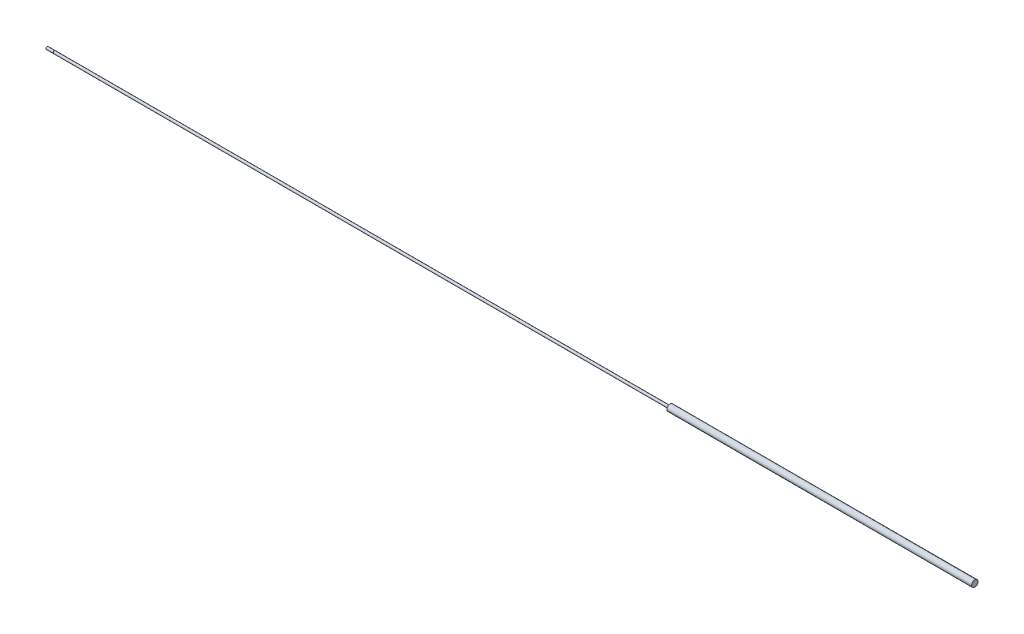
ISO-10303-21;
HEADER;
FILE_DESCRIPTION(('STEP AP214'),'2;1');
FILE_NAME('part.step','',(''),(''),'','','');
FILE_SCHEMA(('AUTOMOTIVE_DESIGN { 1 0 10303 214 1 1 1 1 }'));
ENDSEC;
DATA;
#1=APPLICATION_CONTEXT('core data for automotive mechanical design processes');
#2=APPLICATION_PROTOCOL_DEFINITION('international standard','automotive_design',2000,#1);
#3=PRODUCT_CONTEXT('',#1,'mechanical');
#4=PRODUCT('Part','Part','',(#3));
#5=PRODUCT_RELATED_PRODUCT_CATEGORY('part','',(#4));
#6=PRODUCT_DEFINITION_FORMATION('','',#4);
#7=PRODUCT_DEFINITION_CONTEXT('part definition',#1,'design');
#8=PRODUCT_DEFINITION('design','',#6,#7);
#9=PRODUCT_DEFINITION_SHAPE('','',#8);
#10=(LENGTH_UNIT() NAMED_UNIT(*) SI_UNIT(.MILLI.,.METRE.));
#11=(NAMED_UNIT(*) PLANE_ANGLE_UNIT() SI_UNIT($,.RADIAN.));
#12=(NAMED_UNIT(*) SI_UNIT($,.STERADIAN.) SOLID_ANGLE_UNIT());
#13=UNCERTAINTY_MEASURE_WITH_UNIT(LENGTH_MEASURE(1.E-05),#10,'distance_accuracy_value','');
#14=(GEOMETRIC_REPRESENTATION_CONTEXT(3) GLOBAL_UNCERTAINTY_ASSIGNED_CONTEXT((#13)) GLOBAL_UNIT_ASSIGNED_CONTEXT((#10,
#11,#12)) REPRESENTATION_CONTEXT('',''));
#15=CARTESIAN_POINT('',(0.,0.,0.));
#16=DIRECTION('',(0.,0.,1.));
#17=DIRECTION('',(1.,0.,0.));
#18=AXIS2_PLACEMENT_3D('',#15,#16,#17);
#19=CARTESIAN_POINT('',(1163.1168,0.,0.));
#20=DIRECTION('',(-1.,0.,0.));
#21=DIRECTION('',(0.,0.,1.));
#22=AXIS2_PLACEMENT_3D('',#19,#20,#21);
#23=CYLINDRICAL_SURFACE('',#22,1.5875);
#24=CARTESIAN_POINT('',(777.875,0.,0.));
#25=DIRECTION('',(-1.,0.,0.));
#26=DIRECTION('',(0.,0.,1.));
#27=AXIS2_PLACEMENT_3D('',#24,#25,#26);
#28=CIRCLE('',#27,1.5875);
#29=CARTESIAN_POINT('',(777.875,0.,1.5875));
#30=VERTEX_POINT('',#29);
#31=EDGE_CURVE('E10',#30,#30,#28,.T.);
#32=ORIENTED_EDGE('',*,*,#31,.T.);
#33=EDGE_LOOP('',(#32));
#34=FACE_BOUND('',#33,.T.);
#35=CARTESIAN_POINT('',(0.,0.,0.));
#36=DIRECTION('',(-1.,0.,0.));
#37=DIRECTION('',(0.,0.,1.));
#38=AXIS2_PLACEMENT_3D('',#35,#36,#37);
#39=CIRCLE('',#38,1.5875);
#40=CARTESIAN_POINT('',(0.,0.,1.5875));
#41=VERTEX_POINT('',#40);
#42=EDGE_CURVE('E51',#41,#41,#39,.T.);
#43=ORIENTED_EDGE('',*,*,#42,.F.);
#44=EDGE_LOOP('',(#43));
#45=FACE_BOUND('',#44,.T.);
#46=ADVANCED_FACE('F35',(#34,#45),#23,.T.);
#47=CARTESIAN_POINT('',(777.875,1.5875,0.));
#48=DIRECTION('',(1.,0.,0.));
#49=DIRECTION('',(0.,0.,-1.));
#50=AXIS2_PLACEMENT_3D('',#47,#48,#49);
#51=PLANE('',#50);
#52=ORIENTED_EDGE('',*,*,#31,.F.);
#53=EDGE_LOOP('',(#52));
#54=FACE_BOUND('',#53,.T.);
#55=CARTESIAN_POINT('',(777.875,0.,0.));
#56=DIRECTION('',(-1.,0.,0.));
#57=DIRECTION('',(0.,0.,1.));
#58=AXIS2_PLACEMENT_3D('',#55,#56,#57);
#59=CIRCLE('',#58,4.03225);
#60=CARTESIAN_POINT('',(777.875,0.,4.03225));
#61=VERTEX_POINT('',#60);
#62=EDGE_CURVE('E43',#61,#61,#59,.T.);
#63=ORIENTED_EDGE('',*,*,#62,.T.);
#64=EDGE_LOOP('',(#63));
#65=FACE_BOUND('',#64,.T.);
#66=ADVANCED_FACE('F85',(#54,#65),#51,.F.);
#67=CARTESIAN_POINT('',(1163.1168,0.,0.));
#68=DIRECTION('',(-1.,0.,0.));
#69=DIRECTION('',(0.,0.,1.));
#70=AXIS2_PLACEMENT_3D('',#67,#68,#69);
#71=CYLINDRICAL_SURFACE('',#70,4.03225);
#72=ORIENTED_EDGE('',*,*,#62,.F.);
#73=EDGE_LOOP('',(#72));
#74=FACE_BOUND('',#73,.T.);
#75=CARTESIAN_POINT('',(1163.1168,0.,0.));
#76=DIRECTION('',(-1.,0.,0.));
#77=DIRECTION('',(0.,0.,1.));
#78=AXIS2_PLACEMENT_3D('',#75,#76,#77);
#79=CIRCLE('',#78,4.03225);
#80=CARTESIAN_POINT('',(1163.1168,0.,4.03225));
#81=VERTEX_POINT('',#80);
#82=EDGE_CURVE('E48',#81,#81,#79,.T.);
#83=ORIENTED_EDGE('',*,*,#82,.T.);
#84=EDGE_LOOP('',(#83));
#85=FACE_BOUND('',#84,.T.);
#86=ADVANCED_FACE('F73',(#74,#85),#71,.T.);
#87=CARTESIAN_POINT('',(1163.1168,4.03225,0.));
#88=DIRECTION('',(-1.,0.,0.));
#89=DIRECTION('',(0.,0.,1.));
#90=AXIS2_PLACEMENT_3D('',#87,#88,#89);
#91=PLANE('',#90);
#92=ORIENTED_EDGE('',*,*,#82,.F.);
#93=EDGE_LOOP('',(#92));
#94=FACE_BOUND('',#93,.T.);
#95=ADVANCED_FACE('F75',(#94),#91,.F.);
#96=CARTESIAN_POINT('',(-0.254,1.8415,0.));
#97=DIRECTION('',(1.,0.,0.));
#98=DIRECTION('',(0.,0.,-1.));
#99=AXIS2_PLACEMENT_3D('',#96,#97,#98);
#100=PLANE('',#99);
#101=CARTESIAN_POINT('',(-0.254,0.,0.));
#102=DIRECTION('',(-1.,0.,0.));
#103=DIRECTION('',(0.,0.,1.));
#104=AXIS2_PLACEMENT_3D('',#101,#102,#103);
#105=CIRCLE('',#104,1.3335);
#106=CARTESIAN_POINT('',(-0.254,0.,1.3335));
#107=VERTEX_POINT('',#106);
#108=EDGE_CURVE('E53',#107,#107,#105,.T.);
#109=ORIENTED_EDGE('',*,*,#108,.T.);
#110=EDGE_LOOP('',(#109));
#111=FACE_BOUND('',#110,.T.);
#112=CARTESIAN_POINT('',(-0.253999999999976,0.,0.));
#113=DIRECTION('',(1.,0.,0.));
#114=DIRECTION('',(0.,0.,-1.));
#115=AXIS2_PLACEMENT_3D('',#112,#113,#114);
#116=CIRCLE('',#115,1.5875);
#117=CARTESIAN_POINT('',(-0.253999999999976,0.,-1.5875));
#118=VERTEX_POINT('',#117);
#119=EDGE_CURVE('E39',#118,#118,#116,.T.);
#120=ORIENTED_EDGE('',*,*,#119,.T.);
#121=EDGE_LOOP('',(#120));
#122=FACE_BOUND('',#121,.T.);
#123=ADVANCED_FACE('F77',(#111,#122),#100,.T.);
#124=CARTESIAN_POINT('',(0.,1.3335,0.));
#125=DIRECTION('',(-1.,0.,0.));
#126=DIRECTION('',(0.,0.,1.));
#127=AXIS2_PLACEMENT_3D('',#124,#125,#126);
#128=PLANE('',#127);
#129=CARTESIAN_POINT('',(0.,0.,0.));
#130=DIRECTION('',(-1.,0.,0.));
#131=DIRECTION('',(0.,0.,1.));
#132=AXIS2_PLACEMENT_3D('',#129,#130,#131);
#133=CIRCLE('',#132,1.3335);
#134=CARTESIAN_POINT('',(0.,0.,1.3335));
#135=VERTEX_POINT('',#134);
#136=EDGE_CURVE('E59',#135,#135,#133,.T.);
#137=ORIENTED_EDGE('',*,*,#136,.F.);
#138=EDGE_LOOP('',(#137));
#139=FACE_BOUND('',#138,.T.);
#140=ORIENTED_EDGE('',*,*,#42,.T.);
#141=EDGE_LOOP('',(#140));
#142=FACE_BOUND('',#141,.T.);
#143=ADVANCED_FACE('F83',(#139,#142),#128,.T.);
#144=CARTESIAN_POINT('',(0.,0.,0.));
#145=DIRECTION('',(-1.,0.,0.));
#146=DIRECTION('',(0.,0.,1.));
#147=AXIS2_PLACEMENT_3D('',#144,#145,#146);
#148=CYLINDRICAL_SURFACE('',#147,1.3335);
#149=ORIENTED_EDGE('',*,*,#136,.T.);
#150=EDGE_LOOP('',(#149));
#151=FACE_BOUND('',#150,.T.);
#152=ORIENTED_EDGE('',*,*,#108,.F.);
#153=EDGE_LOOP('',(#152));
#154=FACE_BOUND('',#153,.T.);
#155=ADVANCED_FACE('F112',(#151,#154),#148,.T.);
#156=CARTESIAN_POINT('',(-9.652,0.,0.));
#157=DIRECTION('',(1.,0.,0.));
#158=DIRECTION('',(0.,0.,-1.));
#159=AXIS2_PLACEMENT_3D('',#156,#157,#158);
#160=PLANE('',#159);
#161=CARTESIAN_POINT('',(-9.652,0.,0.));
#162=DIRECTION('',(-1.,0.,0.));
#163=DIRECTION('',(0.,0.,1.));
#164=AXIS2_PLACEMENT_3D('',#161,#162,#163);
#165=CIRCLE('',#164,1.20904);
#166=CARTESIAN_POINT('',(-9.652,0.,1.20904));
#167=VERTEX_POINT('',#166);
#168=EDGE_CURVE('E68',#167,#167,#165,.T.);
#169=ORIENTED_EDGE('',*,*,#168,.T.);
#170=EDGE_LOOP('',(#169));
#171=FACE_BOUND('',#170,.T.);
#172=ADVANCED_FACE('F101',(#171),#160,.F.);
#173=CARTESIAN_POINT('',(-9.27354,0.,0.));
#174=DIRECTION('',(1.,0.,0.));
#175=DIRECTION('',(0.,0.,-1.));
#176=AXIS2_PLACEMENT_3D('',#173,#174,#175);
#177=CONICAL_SURFACE('',#176,1.5875,0.78539816339745);
#178=ORIENTED_EDGE('',*,*,#168,.F.);
#179=EDGE_LOOP('',(#178));
#180=FACE_BOUND('',#179,.T.);
#181=CARTESIAN_POINT('',(-9.27354,0.,0.));
#182=DIRECTION('',(-1.,0.,0.));
#183=DIRECTION('',(0.,0.,1.));
#184=AXIS2_PLACEMENT_3D('',#181,#182,#183);
#185=CIRCLE('',#184,1.5875);
#186=CARTESIAN_POINT('',(-9.27354,0.,1.5875));
#187=VERTEX_POINT('',#186);
#188=EDGE_CURVE('E57',#187,#187,#185,.T.);
#189=ORIENTED_EDGE('',*,*,#188,.T.);
#190=EDGE_LOOP('',(#189));
#191=FACE_BOUND('',#190,.T.);
#192=ADVANCED_FACE('F96',(#180,#191),#177,.T.);
#193=ORIENTED_EDGE('',*,*,#188,.F.);
#194=EDGE_LOOP('',(#193));
#195=FACE_BOUND('',#194,.T.);
#196=ORIENTED_EDGE('',*,*,#119,.F.);
#197=EDGE_LOOP('',(#196));
#198=FACE_BOUND('',#197,.T.);
#199=ADVANCED_FACE('F37',(#195,#198),#23,.T.);
#200=CLOSED_SHELL('',(#46,#66,#86,#95,#123,#143,#155,#172,#192,#199));
#201=MANIFOLD_SOLID_BREP('B2',#200);
#202=ADVANCED_BREP_SHAPE_REPRESENTATION('',(#18,#201),#14);
#203=SHAPE_DEFINITION_REPRESENTATION(#9,#202);
ENDSEC;
END-ISO-10303-21;
